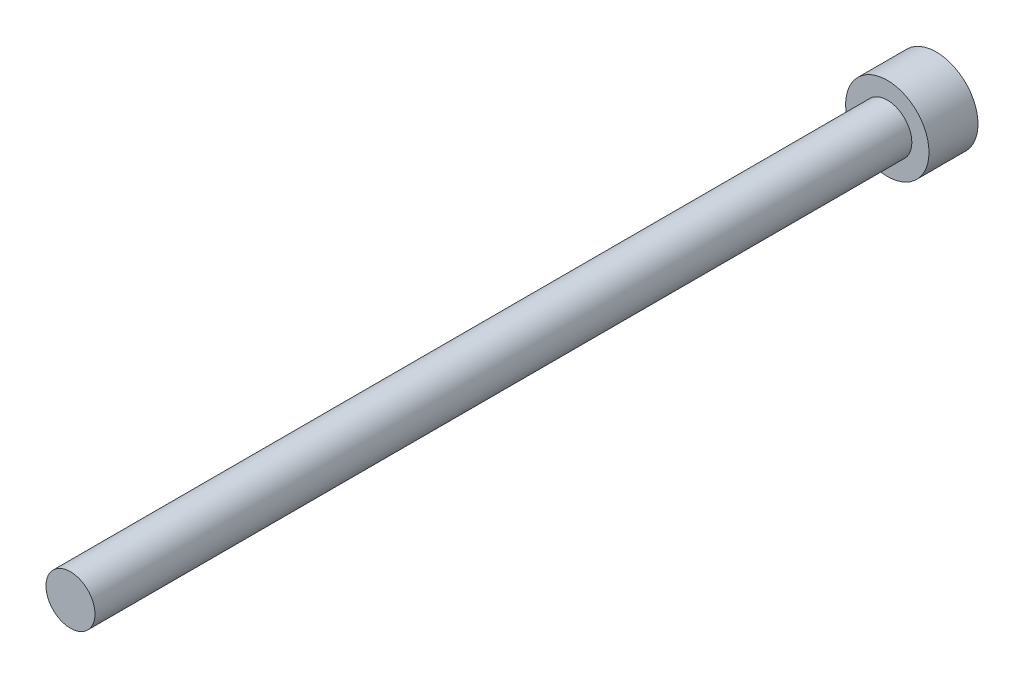
ISO-10303-21;
HEADER;
FILE_DESCRIPTION(('STEP AP214'),'2;1');
FILE_NAME('part.step','',(''),(''),'','','');
FILE_SCHEMA(('AUTOMOTIVE_DESIGN { 1 0 10303 214 1 1 1 1 }'));
ENDSEC;
DATA;
#1=APPLICATION_CONTEXT('core data for automotive mechanical design processes');
#2=APPLICATION_PROTOCOL_DEFINITION('international standard','automotive_design',2000,#1);
#3=PRODUCT_CONTEXT('',#1,'mechanical');
#4=PRODUCT('Part','Part','',(#3));
#5=PRODUCT_RELATED_PRODUCT_CATEGORY('part','',(#4));
#6=PRODUCT_DEFINITION_FORMATION('','',#4);
#7=PRODUCT_DEFINITION_CONTEXT('part definition',#1,'design');
#8=PRODUCT_DEFINITION('design','',#6,#7);
#9=PRODUCT_DEFINITION_SHAPE('','',#8);
#10=(LENGTH_UNIT() NAMED_UNIT(*) SI_UNIT(.MILLI.,.METRE.));
#11=(NAMED_UNIT(*) PLANE_ANGLE_UNIT() SI_UNIT($,.RADIAN.));
#12=(NAMED_UNIT(*) SI_UNIT($,.STERADIAN.) SOLID_ANGLE_UNIT());
#13=UNCERTAINTY_MEASURE_WITH_UNIT(LENGTH_MEASURE(1.E-05),#10,'distance_accuracy_value','');
#14=(GEOMETRIC_REPRESENTATION_CONTEXT(3) GLOBAL_UNCERTAINTY_ASSIGNED_CONTEXT((#13)) GLOBAL_UNIT_ASSIGNED_CONTEXT((#10,
#11,#12)) REPRESENTATION_CONTEXT('',''));
#15=CARTESIAN_POINT('',(0.,0.,0.));
#16=DIRECTION('',(0.,0.,1.));
#17=DIRECTION('',(1.,0.,0.));
#18=AXIS2_PLACEMENT_3D('',#15,#16,#17);
#19=CARTESIAN_POINT('',(0.,0.,6.));
#20=DIRECTION('',(0.,0.,-1.));
#21=DIRECTION('',(-1.,0.,0.));
#22=AXIS2_PLACEMENT_3D('',#19,#20,#21);
#23=CYLINDRICAL_SURFACE('',#22,5.1);
#24=CARTESIAN_POINT('',(0.,0.,6.));
#25=DIRECTION('',(0.,0.,1.));
#26=DIRECTION('',(1.,0.,0.));
#27=AXIS2_PLACEMENT_3D('',#24,#25,#26);
#28=CIRCLE('',#27,5.1);
#29=CARTESIAN_POINT('',(5.1,0.,6.));
#30=VERTEX_POINT('',#29);
#31=EDGE_CURVE('E38',#30,#30,#28,.T.);
#32=ORIENTED_EDGE('',*,*,#31,.F.);
#33=EDGE_LOOP('',(#32));
#34=FACE_BOUND('',#33,.T.);
#35=CARTESIAN_POINT('',(0.,0.,0.));
#36=DIRECTION('',(0.,0.,1.));
#37=DIRECTION('',(1.,0.,0.));
#38=AXIS2_PLACEMENT_3D('',#35,#36,#37);
#39=CIRCLE('',#38,5.1);
#40=CARTESIAN_POINT('',(5.1,0.,0.));
#41=VERTEX_POINT('',#40);
#42=EDGE_CURVE('E34',#41,#41,#39,.T.);
#43=ORIENTED_EDGE('',*,*,#42,.T.);
#44=EDGE_LOOP('',(#43));
#45=FACE_BOUND('',#44,.T.);
#46=ADVANCED_FACE('F31',(#34,#45),#23,.T.);
#47=CARTESIAN_POINT('',(0.,0.,6.));
#48=DIRECTION('',(0.,0.,1.));
#49=DIRECTION('',(1.,0.,0.));
#50=AXIS2_PLACEMENT_3D('',#47,#48,#49);
#51=PLANE('',#50);
#52=CARTESIAN_POINT('',(0.,0.,6.));
#53=DIRECTION('',(0.,0.,1.));
#54=DIRECTION('',(1.,0.,0.));
#55=AXIS2_PLACEMENT_3D('',#52,#53,#54);
#56=CIRCLE('',#55,3.);
#57=CARTESIAN_POINT('',(3.,0.,6.));
#58=VERTEX_POINT('',#57);
#59=EDGE_CURVE('E10',#58,#58,#56,.T.);
#60=ORIENTED_EDGE('',*,*,#59,.F.);
#61=EDGE_LOOP('',(#60));
#62=FACE_BOUND('',#61,.T.);
#63=ORIENTED_EDGE('',*,*,#31,.T.);
#64=EDGE_LOOP('',(#63));
#65=FACE_BOUND('',#64,.T.);
#66=ADVANCED_FACE('F55',(#62,#65),#51,.T.);
#67=CARTESIAN_POINT('',(0.,0.,0.));
#68=DIRECTION('',(0.,0.,1.));
#69=DIRECTION('',(1.,0.,0.));
#70=AXIS2_PLACEMENT_3D('',#67,#68,#69);
#71=PLANE('',#70);
#72=ORIENTED_EDGE('',*,*,#42,.F.);
#73=EDGE_LOOP('',(#72));
#74=FACE_BOUND('',#73,.T.);
#75=ADVANCED_FACE('F52',(#74),#71,.F.);
#76=CARTESIAN_POINT('',(0.,0.,106.));
#77=DIRECTION('',(0.,0.,-1.));
#78=DIRECTION('',(-1.,0.,0.));
#79=AXIS2_PLACEMENT_3D('',#76,#77,#78);
#80=CYLINDRICAL_SURFACE('',#79,3.);
#81=CARTESIAN_POINT('',(0.,0.,106.));
#82=DIRECTION('',(0.,0.,1.));
#83=DIRECTION('',(1.,0.,0.));
#84=AXIS2_PLACEMENT_3D('',#81,#82,#83);
#85=CIRCLE('',#84,3.);
#86=CARTESIAN_POINT('',(3.,0.,106.));
#87=VERTEX_POINT('',#86);
#88=EDGE_CURVE('E44',#87,#87,#85,.T.);
#89=ORIENTED_EDGE('',*,*,#88,.F.);
#90=EDGE_LOOP('',(#89));
#91=FACE_BOUND('',#90,.T.);
#92=ORIENTED_EDGE('',*,*,#59,.T.);
#93=EDGE_LOOP('',(#92));
#94=FACE_BOUND('',#93,.T.);
#95=ADVANCED_FACE('F54',(#91,#94),#80,.T.);
#96=CARTESIAN_POINT('',(0.,0.,106.));
#97=DIRECTION('',(0.,0.,1.));
#98=DIRECTION('',(1.,0.,0.));
#99=AXIS2_PLACEMENT_3D('',#96,#97,#98);
#100=PLANE('',#99);
#101=ORIENTED_EDGE('',*,*,#88,.T.);
#102=EDGE_LOOP('',(#101));
#103=FACE_BOUND('',#102,.T.);
#104=ADVANCED_FACE('F60',(#103),#100,.T.);
#105=CLOSED_SHELL('',(#46,#66,#75,#95,#104));
#106=MANIFOLD_SOLID_BREP('B2',#105);
#107=ADVANCED_BREP_SHAPE_REPRESENTATION('',(#18,#106),#14);
#108=SHAPE_DEFINITION_REPRESENTATION(#9,#107);
ENDSEC;
END-ISO-10303-21;
